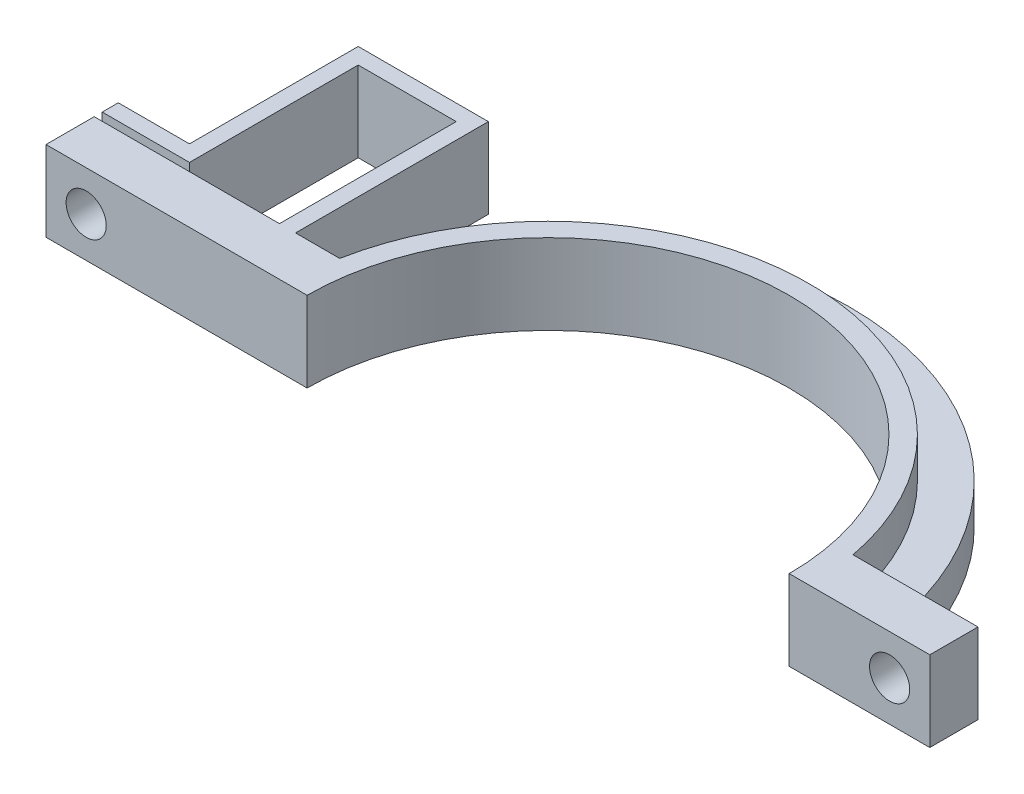
ISO-10303-21;
HEADER;
FILE_DESCRIPTION(('STEP AP214'),'2;1');
FILE_NAME('part.step','',(''),(''),'','','');
FILE_SCHEMA(('AUTOMOTIVE_DESIGN { 1 0 10303 214 1 1 1 1 }'));
ENDSEC;
DATA;
#1=APPLICATION_CONTEXT('core data for automotive mechanical design processes');
#2=APPLICATION_PROTOCOL_DEFINITION('international standard','automotive_design',2000,#1);
#3=PRODUCT_CONTEXT('',#1,'mechanical');
#4=PRODUCT('Part','Part','',(#3));
#5=PRODUCT_RELATED_PRODUCT_CATEGORY('part','',(#4));
#6=PRODUCT_DEFINITION_FORMATION('','',#4);
#7=PRODUCT_DEFINITION_CONTEXT('part definition',#1,'design');
#8=PRODUCT_DEFINITION('design','',#6,#7);
#9=PRODUCT_DEFINITION_SHAPE('','',#8);
#10=(LENGTH_UNIT() NAMED_UNIT(*) SI_UNIT(.MILLI.,.METRE.));
#11=(NAMED_UNIT(*) PLANE_ANGLE_UNIT() SI_UNIT($,.RADIAN.));
#12=(NAMED_UNIT(*) SI_UNIT($,.STERADIAN.) SOLID_ANGLE_UNIT());
#13=UNCERTAINTY_MEASURE_WITH_UNIT(LENGTH_MEASURE(1.E-05),#10,'distance_accuracy_value','');
#14=(GEOMETRIC_REPRESENTATION_CONTEXT(3) GLOBAL_UNCERTAINTY_ASSIGNED_CONTEXT((#13)) GLOBAL_UNIT_ASSIGNED_CONTEXT((#10,
#11,#12)) REPRESENTATION_CONTEXT('',''));
#15=CARTESIAN_POINT('',(0.,0.,0.));
#16=DIRECTION('',(0.,0.,1.));
#17=DIRECTION('',(1.,0.,0.));
#18=AXIS2_PLACEMENT_3D('',#15,#16,#17);
#19=CARTESIAN_POINT('',(0.,10.,-6.));
#20=DIRECTION('',(0.,0.,-1.));
#21=DIRECTION('',(-1.,0.,0.));
#22=AXIS2_PLACEMENT_3D('',#19,#20,#21);
#23=PLANE('',#22);
#24=DIRECTION('',(1.,0.,0.));
#25=VECTOR('',#24,1.);
#26=CARTESIAN_POINT('',(0.,0.,-6.));
#27=LINE('',#26,#25);
#28=CARTESIAN_POINT('',(-37.4413525073689,0.,-6.));
#29=VERTEX_POINT('',#28);
#30=CARTESIAN_POINT('',(-37.0168880377592,0.,-6.));
#31=VERTEX_POINT('',#30);
#32=EDGE_CURVE('E288',#29,#31,#27,.T.);
#33=ORIENTED_EDGE('',*,*,#32,.F.);
#34=DIRECTION('',(0.,-1.,0.));
#35=VECTOR('',#34,1.);
#36=CARTESIAN_POINT('',(-37.4413525073689,10.,-6.));
#37=LINE('',#36,#35);
#38=CARTESIAN_POINT('',(-37.4413525073689,10.,-6.));
#39=VERTEX_POINT('',#38);
#40=EDGE_CURVE('E362',#39,#29,#37,.T.);
#41=ORIENTED_EDGE('',*,*,#40,.F.);
#42=DIRECTION('',(1.,0.,0.));
#43=VECTOR('',#42,1.);
#44=CARTESIAN_POINT('',(0.,10.,-6.));
#45=LINE('',#44,#43);
#46=CARTESIAN_POINT('',(-31.9413525073689,10.,-6.));
#47=VERTEX_POINT('',#46);
#48=EDGE_CURVE('E261',#39,#47,#45,.T.);
#49=ORIENTED_EDGE('',*,*,#48,.T.);
#50=DIRECTION('',(0.,-1.,0.));
#51=VECTOR('',#50,1.);
#52=CARTESIAN_POINT('',(-31.9413525073689,10.,-6.));
#53=LINE('',#52,#51);
#54=CARTESIAN_POINT('',(-31.9413525073689,5.,-6.));
#55=VERTEX_POINT('',#54);
#56=EDGE_CURVE('E315',#47,#55,#53,.T.);
#57=ORIENTED_EDGE('',*,*,#56,.T.);
#58=DIRECTION('',(1.,0.,0.));
#59=VECTOR('',#58,1.);
#60=CARTESIAN_POINT('',(0.,5.,-6.));
#61=LINE('',#60,#59);
#62=CARTESIAN_POINT('',(-37.0168880377592,5.,-6.));
#63=VERTEX_POINT('',#62);
#64=EDGE_CURVE('E238',#63,#55,#61,.T.);
#65=ORIENTED_EDGE('',*,*,#64,.F.);
#66=DIRECTION('',(0.,-1.,0.));
#67=VECTOR('',#66,1.);
#68=CARTESIAN_POINT('',(-37.0168880377592,5.,-6.));
#69=LINE('',#68,#67);
#70=EDGE_CURVE('E231',#63,#31,#69,.T.);
#71=ORIENTED_EDGE('',*,*,#70,.T.);
#72=EDGE_LOOP('',(#33,#41,#49,#57,#65,#71));
#73=FACE_BOUND('',#72,.T.);
#74=ADVANCED_FACE('F47',(#73),#23,.T.);
#75=CARTESIAN_POINT('',(0.,10.,-6.));
#76=DIRECTION('',(0.,0.,1.));
#77=DIRECTION('',(1.,0.,0.));
#78=AXIS2_PLACEMENT_3D('',#75,#76,#77);
#79=PLANE('',#78);
#80=CARTESIAN_POINT('',(42.5,5.,-6.00000000000001));
#81=DIRECTION('',(0.,0.,1.));
#82=DIRECTION('',(1.,0.,0.));
#83=AXIS2_PLACEMENT_3D('',#80,#81,#82);
#84=CIRCLE('',#83,2.5);
#85=CARTESIAN_POINT('',(45.,5.,-6.00000000000001));
#86=VERTEX_POINT('',#85);
#87=EDGE_CURVE('E439',#86,#86,#84,.T.);
#88=ORIENTED_EDGE('',*,*,#87,.T.);
#89=EDGE_LOOP('',(#88));
#90=FACE_BOUND('',#89,.T.);
#91=DIRECTION('',(0.,-1.,0.));
#92=VECTOR('',#91,1.);
#93=CARTESIAN_POINT('',(37.0168880377592,5.,-6.00000000000001));
#94=LINE('',#93,#92);
#95=CARTESIAN_POINT('',(37.0168880377592,5.,-6.00000000000001));
#96=VERTEX_POINT('',#95);
#97=CARTESIAN_POINT('',(37.0168880377592,0.,-6.00000000000001));
#98=VERTEX_POINT('',#97);
#99=EDGE_CURVE('E72',#96,#98,#94,.T.);
#100=ORIENTED_EDGE('',*,*,#99,.F.);
#101=DIRECTION('',(-1.,0.,0.));
#102=VECTOR('',#101,1.);
#103=CARTESIAN_POINT('',(0.,5.,-6.));
#104=LINE('',#103,#102);
#105=CARTESIAN_POINT('',(31.9413525073689,5.,-6.));
#106=VERTEX_POINT('',#105);
#107=EDGE_CURVE('E242',#96,#106,#104,.T.);
#108=ORIENTED_EDGE('',*,*,#107,.T.);
#109=DIRECTION('',(0.,-1.,0.));
#110=VECTOR('',#109,1.);
#111=CARTESIAN_POINT('',(31.9413525073689,10.,-6.));
#112=LINE('',#111,#110);
#113=CARTESIAN_POINT('',(31.9413525073689,10.,-6.));
#114=VERTEX_POINT('',#113);
#115=EDGE_CURVE('E319',#114,#106,#112,.T.);
#116=ORIENTED_EDGE('',*,*,#115,.F.);
#117=DIRECTION('',(-1.,0.,0.));
#118=VECTOR('',#117,1.);
#119=CARTESIAN_POINT('',(0.,10.,-6.));
#120=LINE('',#119,#118);
#121=CARTESIAN_POINT('',(47.5,10.,-6.00000000000001));
#122=VERTEX_POINT('',#121);
#123=EDGE_CURVE('E254',#122,#114,#120,.T.);
#124=ORIENTED_EDGE('',*,*,#123,.F.);
#125=DIRECTION('',(0.,-1.,0.));
#126=VECTOR('',#125,1.);
#127=CARTESIAN_POINT('',(47.5,10.,-6.00000000000001));
#128=LINE('',#127,#126);
#129=CARTESIAN_POINT('',(47.5,0.,-6.00000000000001));
#130=VERTEX_POINT('',#129);
#131=EDGE_CURVE('E57',#122,#130,#128,.T.);
#132=ORIENTED_EDGE('',*,*,#131,.T.);
#133=DIRECTION('',(-1.,0.,0.));
#134=VECTOR('',#133,1.);
#135=CARTESIAN_POINT('',(0.,0.,-6.));
#136=LINE('',#135,#134);
#137=EDGE_CURVE('E285',#130,#98,#136,.T.);
#138=ORIENTED_EDGE('',*,*,#137,.T.);
#139=EDGE_LOOP('',(#100,#108,#116,#124,#132,#138));
#140=FACE_BOUND('',#139,.T.);
#141=ADVANCED_FACE('F326',(#90,#140),#79,.F.);
#142=CARTESIAN_POINT('',(-57.5,5.,-6.));
#143=DIRECTION('',(0.,0.,-1.));
#144=DIRECTION('',(-1.,0.,0.));
#145=AXIS2_PLACEMENT_3D('',#142,#143,#144);
#146=CIRCLE('',#145,2.5);
#147=CARTESIAN_POINT('',(-60.,5.,-6.));
#148=VERTEX_POINT('',#147);
#149=EDGE_CURVE('E444',#148,#148,#146,.T.);
#150=ORIENTED_EDGE('',*,*,#149,.F.);
#151=EDGE_LOOP('',(#150));
#152=FACE_BOUND('',#151,.T.);
#153=DIRECTION('',(0.,-1.,0.));
#154=VECTOR('',#153,1.);
#155=CARTESIAN_POINT('',(-39.4413525073689,10.,-6.));
#156=LINE('',#155,#154);
#157=CARTESIAN_POINT('',(-39.4413525073689,10.,-6.));
#158=VERTEX_POINT('',#157);
#159=CARTESIAN_POINT('',(-39.4413525073689,0.,-6.));
#160=VERTEX_POINT('',#159);
#161=EDGE_CURVE('E356',#158,#160,#156,.T.);
#162=ORIENTED_EDGE('',*,*,#161,.T.);
#163=CARTESIAN_POINT('',(-62.5,0.,-6.));
#164=VERTEX_POINT('',#163);
#165=EDGE_CURVE('E289',#164,#160,#27,.T.);
#166=ORIENTED_EDGE('',*,*,#165,.F.);
#167=DIRECTION('',(0.,-1.,0.));
#168=VECTOR('',#167,1.);
#169=CARTESIAN_POINT('',(-62.5,10.,-6.));
#170=LINE('',#169,#168);
#171=CARTESIAN_POINT('',(-62.5,10.,-6.));
#172=VERTEX_POINT('',#171);
#173=EDGE_CURVE('E312',#172,#164,#170,.T.);
#174=ORIENTED_EDGE('',*,*,#173,.F.);
#175=EDGE_CURVE('E262',#172,#158,#45,.T.);
#176=ORIENTED_EDGE('',*,*,#175,.T.);
#177=EDGE_LOOP('',(#162,#166,#174,#176));
#178=FACE_BOUND('',#177,.T.);
#179=ADVANCED_FACE('F355',(#152,#178),#23,.T.);
#180=CARTESIAN_POINT('',(0.,10.,0.));
#181=DIRECTION('',(0.,0.,-1.));
#182=DIRECTION('',(-1.,0.,0.));
#183=AXIS2_PLACEMENT_3D('',#180,#181,#182);
#184=PLANE('',#183);
#185=CARTESIAN_POINT('',(42.5,5.,0.));
#186=DIRECTION('',(0.,0.,1.));
#187=DIRECTION('',(1.,0.,0.));
#188=AXIS2_PLACEMENT_3D('',#185,#186,#187);
#189=CIRCLE('',#188,2.5);
#190=CARTESIAN_POINT('',(45.,5.,0.));
#191=VERTEX_POINT('',#190);
#192=EDGE_CURVE('E455',#191,#191,#189,.T.);
#193=ORIENTED_EDGE('',*,*,#192,.F.);
#194=EDGE_LOOP('',(#193));
#195=FACE_BOUND('',#194,.T.);
#196=DIRECTION('',(1.,0.,0.));
#197=VECTOR('',#196,1.);
#198=CARTESIAN_POINT('',(0.,0.,0.));
#199=LINE('',#198,#197);
#200=CARTESIAN_POINT('',(30.,0.,0.));
#201=VERTEX_POINT('',#200);
#202=CARTESIAN_POINT('',(47.5,0.,0.));
#203=VERTEX_POINT('',#202);
#204=EDGE_CURVE('E245',#201,#203,#199,.T.);
#205=ORIENTED_EDGE('',*,*,#204,.T.);
#206=DIRECTION('',(0.,-1.,0.));
#207=VECTOR('',#206,1.);
#208=CARTESIAN_POINT('',(47.5,10.,0.));
#209=LINE('',#208,#207);
#210=CARTESIAN_POINT('',(47.5,10.,0.));
#211=VERTEX_POINT('',#210);
#212=EDGE_CURVE('E11',#211,#203,#209,.T.);
#213=ORIENTED_EDGE('',*,*,#212,.F.);
#214=DIRECTION('',(1.,0.,0.));
#215=VECTOR('',#214,1.);
#216=CARTESIAN_POINT('',(0.,10.,0.));
#217=LINE('',#216,#215);
#218=CARTESIAN_POINT('',(30.,10.,0.));
#219=VERTEX_POINT('',#218);
#220=EDGE_CURVE('E246',#219,#211,#217,.T.);
#221=ORIENTED_EDGE('',*,*,#220,.F.);
#222=DIRECTION('',(0.,-1.,0.));
#223=VECTOR('',#222,1.);
#224=CARTESIAN_POINT('',(30.,10.,0.));
#225=LINE('',#224,#223);
#226=EDGE_CURVE('E278',#219,#201,#225,.T.);
#227=ORIENTED_EDGE('',*,*,#226,.T.);
#228=EDGE_LOOP('',(#205,#213,#221,#227));
#229=FACE_BOUND('',#228,.T.);
#230=ADVANCED_FACE('F49',(#195,#229),#184,.F.);
#231=CARTESIAN_POINT('',(47.5,10.,0.));
#232=DIRECTION('',(1.,0.,0.));
#233=DIRECTION('',(0.,0.,-1.));
#234=AXIS2_PLACEMENT_3D('',#231,#232,#233);
#235=PLANE('',#234);
#236=DIRECTION('',(0.,0.,1.));
#237=VECTOR('',#236,1.);
#238=CARTESIAN_POINT('',(47.5,0.,0.));
#239=LINE('',#238,#237);
#240=EDGE_CURVE('E281',#130,#203,#239,.T.);
#241=ORIENTED_EDGE('',*,*,#240,.F.);
#242=ORIENTED_EDGE('',*,*,#131,.F.);
#243=DIRECTION('',(0.,0.,1.));
#244=VECTOR('',#243,1.);
#245=CARTESIAN_POINT('',(47.5,10.,0.));
#246=LINE('',#245,#244);
#247=EDGE_CURVE('E249',#122,#211,#246,.T.);
#248=ORIENTED_EDGE('',*,*,#247,.T.);
#249=ORIENTED_EDGE('',*,*,#212,.T.);
#250=EDGE_LOOP('',(#241,#242,#248,#249));
#251=FACE_BOUND('',#250,.T.);
#252=ADVANCED_FACE('F334',(#251),#235,.T.);
#253=CARTESIAN_POINT('',(0.,10.,0.));
#254=DIRECTION('',(0.,-1.,0.));
#255=DIRECTION('',(0.,0.,-1.));
#256=AXIS2_PLACEMENT_3D('',#253,#254,#255);
#257=CYLINDRICAL_SURFACE('',#256,32.5);
#258=ORIENTED_EDGE('',*,*,#115,.T.);
#259=CARTESIAN_POINT('',(0.,5.,0.));
#260=DIRECTION('',(0.,1.,0.));
#261=DIRECTION('',(0.,0.,1.));
#262=AXIS2_PLACEMENT_3D('',#259,#260,#261);
#263=CIRCLE('',#262,32.5);
#264=EDGE_CURVE('E220',#106,#55,#263,.T.);
#265=ORIENTED_EDGE('',*,*,#264,.T.);
#266=ORIENTED_EDGE('',*,*,#56,.F.);
#267=CARTESIAN_POINT('',(0.,10.,0.));
#268=DIRECTION('',(0.,1.,0.));
#269=DIRECTION('',(0.,0.,1.));
#270=AXIS2_PLACEMENT_3D('',#267,#268,#269);
#271=CIRCLE('',#270,32.5);
#272=EDGE_CURVE('E257',#114,#47,#271,.T.);
#273=ORIENTED_EDGE('',*,*,#272,.F.);
#274=EDGE_LOOP('',(#258,#265,#266,#273));
#275=FACE_BOUND('',#274,.T.);
#276=ADVANCED_FACE('F491',(#275),#257,.T.);
#277=CARTESIAN_POINT('',(-62.5,10.,0.));
#278=DIRECTION('',(-1.,0.,0.));
#279=DIRECTION('',(0.,0.,1.));
#280=AXIS2_PLACEMENT_3D('',#277,#278,#279);
#281=PLANE('',#280);
#282=DIRECTION('',(0.,0.,-1.));
#283=VECTOR('',#282,1.);
#284=CARTESIAN_POINT('',(-62.5,0.,0.));
#285=LINE('',#284,#283);
#286=CARTESIAN_POINT('',(-62.5,0.,0.));
#287=VERTEX_POINT('',#286);
#288=EDGE_CURVE('E293',#287,#164,#285,.T.);
#289=ORIENTED_EDGE('',*,*,#288,.F.);
#290=DIRECTION('',(0.,-1.,0.));
#291=VECTOR('',#290,1.);
#292=CARTESIAN_POINT('',(-62.5,10.,0.));
#293=LINE('',#292,#291);
#294=CARTESIAN_POINT('',(-62.5,10.,0.));
#295=VERTEX_POINT('',#294);
#296=EDGE_CURVE('E308',#295,#287,#293,.T.);
#297=ORIENTED_EDGE('',*,*,#296,.F.);
#298=DIRECTION('',(0.,0.,-1.));
#299=VECTOR('',#298,1.);
#300=CARTESIAN_POINT('',(-62.5,10.,0.));
#301=LINE('',#300,#299);
#302=EDGE_CURVE('E266',#295,#172,#301,.T.);
#303=ORIENTED_EDGE('',*,*,#302,.T.);
#304=ORIENTED_EDGE('',*,*,#173,.T.);
#305=EDGE_LOOP('',(#289,#297,#303,#304));
#306=FACE_BOUND('',#305,.T.);
#307=ADVANCED_FACE('F350',(#306),#281,.T.);
#308=CARTESIAN_POINT('',(0.,10.,0.));
#309=DIRECTION('',(0.,0.,1.));
#310=DIRECTION('',(1.,0.,0.));
#311=AXIS2_PLACEMENT_3D('',#308,#309,#310);
#312=PLANE('',#311);
#313=CARTESIAN_POINT('',(-57.5,5.,0.));
#314=DIRECTION('',(0.,0.,1.));
#315=DIRECTION('',(1.,0.,0.));
#316=AXIS2_PLACEMENT_3D('',#313,#314,#315);
#317=CIRCLE('',#316,2.5);
#318=CARTESIAN_POINT('',(-55.,5.,0.));
#319=VERTEX_POINT('',#318);
#320=EDGE_CURVE('E458',#319,#319,#317,.T.);
#321=ORIENTED_EDGE('',*,*,#320,.F.);
#322=EDGE_LOOP('',(#321));
#323=FACE_BOUND('',#322,.T.);
#324=ORIENTED_EDGE('',*,*,#296,.T.);
#325=DIRECTION('',(-1.,0.,0.));
#326=VECTOR('',#325,1.);
#327=CARTESIAN_POINT('',(0.,0.,0.));
#328=LINE('',#327,#326);
#329=CARTESIAN_POINT('',(-30.,0.,0.));
#330=VERTEX_POINT('',#329);
#331=EDGE_CURVE('E297',#330,#287,#328,.T.);
#332=ORIENTED_EDGE('',*,*,#331,.F.);
#333=DIRECTION('',(0.,-1.,0.));
#334=VECTOR('',#333,1.);
#335=CARTESIAN_POINT('',(-30.,10.,0.));
#336=LINE('',#335,#334);
#337=CARTESIAN_POINT('',(-30.,10.,0.));
#338=VERTEX_POINT('',#337);
#339=EDGE_CURVE('E305',#338,#330,#336,.T.);
#340=ORIENTED_EDGE('',*,*,#339,.F.);
#341=DIRECTION('',(-1.,0.,0.));
#342=VECTOR('',#341,1.);
#343=CARTESIAN_POINT('',(0.,10.,0.));
#344=LINE('',#343,#342);
#345=EDGE_CURVE('E270',#338,#295,#344,.T.);
#346=ORIENTED_EDGE('',*,*,#345,.T.);
#347=EDGE_LOOP('',(#324,#332,#340,#346));
#348=FACE_BOUND('',#347,.T.);
#349=ADVANCED_FACE('F345',(#323,#348),#312,.T.);
#350=CARTESIAN_POINT('',(0.,10.,0.));
#351=DIRECTION('',(0.,-1.,0.));
#352=DIRECTION('',(0.,0.,-1.));
#353=AXIS2_PLACEMENT_3D('',#350,#351,#352);
#354=CYLINDRICAL_SURFACE('',#353,30.);
#355=CARTESIAN_POINT('',(0.,0.,0.));
#356=DIRECTION('',(0.,1.,0.));
#357=DIRECTION('',(0.,0.,1.));
#358=AXIS2_PLACEMENT_3D('',#355,#356,#357);
#359=CIRCLE('',#358,30.);
#360=EDGE_CURVE('E250',#201,#330,#359,.T.);
#361=ORIENTED_EDGE('',*,*,#360,.F.);
#362=ORIENTED_EDGE('',*,*,#226,.F.);
#363=CARTESIAN_POINT('',(0.,10.,0.));
#364=DIRECTION('',(0.,1.,0.));
#365=DIRECTION('',(0.,0.,1.));
#366=AXIS2_PLACEMENT_3D('',#363,#364,#365);
#367=CIRCLE('',#366,30.);
#368=EDGE_CURVE('E274',#219,#338,#367,.T.);
#369=ORIENTED_EDGE('',*,*,#368,.T.);
#370=ORIENTED_EDGE('',*,*,#339,.T.);
#371=EDGE_LOOP('',(#361,#362,#369,#370));
#372=FACE_BOUND('',#371,.T.);
#373=ADVANCED_FACE('F341',(#372),#354,.F.);
#374=CARTESIAN_POINT('',(0.,10.,0.));
#375=DIRECTION('',(0.,1.,0.));
#376=DIRECTION('',(0.,0.,1.));
#377=AXIS2_PLACEMENT_3D('',#374,#375,#376);
#378=PLANE('',#377);
#379=ORIENTED_EDGE('',*,*,#220,.T.);
#380=ORIENTED_EDGE('',*,*,#247,.F.);
#381=ORIENTED_EDGE('',*,*,#123,.T.);
#382=ORIENTED_EDGE('',*,*,#272,.T.);
#383=ORIENTED_EDGE('',*,*,#48,.F.);
#384=DIRECTION('',(0.,0.,-1.));
#385=VECTOR('',#384,1.);
#386=CARTESIAN_POINT('',(-37.4413525073689,10.,0.));
#387=LINE('',#386,#385);
#388=CARTESIAN_POINT('',(-37.4413525073689,10.,-30.));
#389=VERTEX_POINT('',#388);
#390=EDGE_CURVE('E472',#39,#389,#387,.T.);
#391=ORIENTED_EDGE('',*,*,#390,.T.);
#392=DIRECTION('',(-1.,0.,0.));
#393=VECTOR('',#392,1.);
#394=CARTESIAN_POINT('',(0.,10.,-30.));
#395=LINE('',#394,#393);
#396=CARTESIAN_POINT('',(-53.6413525073689,10.,-30.));
#397=VERTEX_POINT('',#396);
#398=EDGE_CURVE('E421',#389,#397,#395,.T.);
#399=ORIENTED_EDGE('',*,*,#398,.T.);
#400=DIRECTION('',(0.,0.,1.));
#401=VECTOR('',#400,1.);
#402=CARTESIAN_POINT('',(-53.6413525073689,10.,0.));
#403=LINE('',#402,#401);
#404=CARTESIAN_POINT('',(-53.6413525073689,10.,-9.));
#405=VERTEX_POINT('',#404);
#406=EDGE_CURVE('E432',#397,#405,#403,.T.);
#407=ORIENTED_EDGE('',*,*,#406,.T.);
#408=DIRECTION('',(-1.,0.,0.));
#409=VECTOR('',#408,1.);
#410=CARTESIAN_POINT('',(0.,10.,-9.00000000000002));
#411=LINE('',#410,#409);
#412=CARTESIAN_POINT('',(-62.5,10.,-9.));
#413=VERTEX_POINT('',#412);
#414=EDGE_CURVE('E204',#405,#413,#411,.T.);
#415=ORIENTED_EDGE('',*,*,#414,.T.);
#416=DIRECTION('',(0.,0.,1.));
#417=VECTOR('',#416,1.);
#418=CARTESIAN_POINT('',(-62.4999999999999,10.,4.33680868994201E-13));
#419=LINE('',#418,#417);
#420=CARTESIAN_POINT('',(-62.5,10.,-7.));
#421=VERTEX_POINT('',#420);
#422=EDGE_CURVE('E199',#413,#421,#419,.T.);
#423=ORIENTED_EDGE('',*,*,#422,.T.);
#424=DIRECTION('',(1.,0.,0.));
#425=VECTOR('',#424,1.);
#426=CARTESIAN_POINT('',(0.,10.,-6.99999999999999));
#427=LINE('',#426,#425);
#428=CARTESIAN_POINT('',(-51.6413525073689,10.,-7.));
#429=VERTEX_POINT('',#428);
#430=EDGE_CURVE('E186',#421,#429,#427,.T.);
#431=ORIENTED_EDGE('',*,*,#430,.T.);
#432=DIRECTION('',(0.,0.,1.));
#433=VECTOR('',#432,1.);
#434=CARTESIAN_POINT('',(-51.6413525073689,10.,0.));
#435=LINE('',#434,#433);
#436=CARTESIAN_POINT('',(-51.6413525073689,10.,-28.));
#437=VERTEX_POINT('',#436);
#438=EDGE_CURVE('E198',#437,#429,#435,.T.);
#439=ORIENTED_EDGE('',*,*,#438,.F.);
#440=DIRECTION('',(-1.,0.,0.));
#441=VECTOR('',#440,1.);
#442=CARTESIAN_POINT('',(0.,10.,-28.));
#443=LINE('',#442,#441);
#444=CARTESIAN_POINT('',(-39.4413525073689,10.,-28.));
#445=VERTEX_POINT('',#444);
#446=EDGE_CURVE('E379',#445,#437,#443,.T.);
#447=ORIENTED_EDGE('',*,*,#446,.F.);
#448=DIRECTION('',(0.,0.,-1.));
#449=VECTOR('',#448,1.);
#450=CARTESIAN_POINT('',(-39.4413525073689,10.,0.));
#451=LINE('',#450,#449);
#452=EDGE_CURVE('E469',#158,#445,#451,.T.);
#453=ORIENTED_EDGE('',*,*,#452,.F.);
#454=ORIENTED_EDGE('',*,*,#175,.F.);
#455=ORIENTED_EDGE('',*,*,#302,.F.);
#456=ORIENTED_EDGE('',*,*,#345,.F.);
#457=ORIENTED_EDGE('',*,*,#368,.F.);
#458=EDGE_LOOP('',(#379,#380,#381,#382,#383,#391,#399,#407,#415,#423,#431,#439,#447,#453,#454,
#455,#456,#457));
#459=FACE_BOUND('',#458,.T.);
#460=ADVANCED_FACE('F202',(#459),#378,.T.);
#461=CARTESIAN_POINT('',(0.,0.,0.));
#462=DIRECTION('',(0.,1.,0.));
#463=DIRECTION('',(0.,0.,1.));
#464=AXIS2_PLACEMENT_3D('',#461,#462,#463);
#465=PLANE('',#464);
#466=ORIENTED_EDGE('',*,*,#331,.T.);
#467=ORIENTED_EDGE('',*,*,#288,.T.);
#468=ORIENTED_EDGE('',*,*,#165,.T.);
#469=DIRECTION('',(0.,0.,-1.));
#470=VECTOR('',#469,1.);
#471=CARTESIAN_POINT('',(-39.4413525073689,0.,0.));
#472=LINE('',#471,#470);
#473=CARTESIAN_POINT('',(-39.4413525073689,0.,-28.));
#474=VERTEX_POINT('',#473);
#475=EDGE_CURVE('E387',#160,#474,#472,.T.);
#476=ORIENTED_EDGE('',*,*,#475,.T.);
#477=DIRECTION('',(-1.,0.,0.));
#478=VECTOR('',#477,1.);
#479=CARTESIAN_POINT('',(0.,0.,-28.));
#480=LINE('',#479,#478);
#481=CARTESIAN_POINT('',(-51.6413525073689,0.,-28.));
#482=VERTEX_POINT('',#481);
#483=EDGE_CURVE('E377',#474,#482,#480,.T.);
#484=ORIENTED_EDGE('',*,*,#483,.T.);
#485=DIRECTION('',(0.,0.,1.));
#486=VECTOR('',#485,1.);
#487=CARTESIAN_POINT('',(-51.6413525073689,0.,0.));
#488=LINE('',#487,#486);
#489=CARTESIAN_POINT('',(-51.6413525073689,0.,-7.));
#490=VERTEX_POINT('',#489);
#491=EDGE_CURVE('E382',#482,#490,#488,.T.);
#492=ORIENTED_EDGE('',*,*,#491,.T.);
#493=DIRECTION('',(1.,0.,0.));
#494=VECTOR('',#493,1.);
#495=CARTESIAN_POINT('',(0.,0.,-6.99999999999999));
#496=LINE('',#495,#494);
#497=CARTESIAN_POINT('',(-62.5,0.,-7.));
#498=VERTEX_POINT('',#497);
#499=EDGE_CURVE('E385',#498,#490,#496,.T.);
#500=ORIENTED_EDGE('',*,*,#499,.F.);
#501=DIRECTION('',(0.,0.,1.));
#502=VECTOR('',#501,1.);
#503=CARTESIAN_POINT('',(-62.4999999999999,0.,4.33680868994201E-13));
#504=LINE('',#503,#502);
#505=CARTESIAN_POINT('',(-62.5,0.,-9.));
#506=VERTEX_POINT('',#505);
#507=EDGE_CURVE('E213',#506,#498,#504,.T.);
#508=ORIENTED_EDGE('',*,*,#507,.F.);
#509=DIRECTION('',(-1.,0.,0.));
#510=VECTOR('',#509,1.);
#511=CARTESIAN_POINT('',(0.,0.,-9.00000000000002));
#512=LINE('',#511,#510);
#513=CARTESIAN_POINT('',(-53.6413525073689,0.,-9.));
#514=VERTEX_POINT('',#513);
#515=EDGE_CURVE('E209',#514,#506,#512,.T.);
#516=ORIENTED_EDGE('',*,*,#515,.F.);
#517=DIRECTION('',(0.,0.,1.));
#518=VECTOR('',#517,1.);
#519=CARTESIAN_POINT('',(-53.6413525073689,0.,0.));
#520=LINE('',#519,#518);
#521=CARTESIAN_POINT('',(-53.6413525073689,0.,-30.));
#522=VERTEX_POINT('',#521);
#523=EDGE_CURVE('E399',#522,#514,#520,.T.);
#524=ORIENTED_EDGE('',*,*,#523,.F.);
#525=DIRECTION('',(-1.,0.,0.));
#526=VECTOR('',#525,1.);
#527=CARTESIAN_POINT('',(0.,0.,-30.));
#528=LINE('',#527,#526);
#529=CARTESIAN_POINT('',(-37.4413525073689,0.,-30.));
#530=VERTEX_POINT('',#529);
#531=EDGE_CURVE('E396',#530,#522,#528,.T.);
#532=ORIENTED_EDGE('',*,*,#531,.F.);
#533=DIRECTION('',(0.,0.,-1.));
#534=VECTOR('',#533,1.);
#535=CARTESIAN_POINT('',(-37.4413525073689,0.,0.));
#536=LINE('',#535,#534);
#537=EDGE_CURVE('E64',#29,#530,#536,.T.);
#538=ORIENTED_EDGE('',*,*,#537,.F.);
#539=ORIENTED_EDGE('',*,*,#32,.T.);
#540=CARTESIAN_POINT('',(0.,0.,0.));
#541=DIRECTION('',(0.,1.,0.));
#542=DIRECTION('',(0.,0.,1.));
#543=AXIS2_PLACEMENT_3D('',#540,#541,#542);
#544=CIRCLE('',#543,37.5);
#545=EDGE_CURVE('E215',#98,#31,#544,.T.);
#546=ORIENTED_EDGE('',*,*,#545,.F.);
#547=ORIENTED_EDGE('',*,*,#137,.F.);
#548=ORIENTED_EDGE('',*,*,#240,.T.);
#549=ORIENTED_EDGE('',*,*,#204,.F.);
#550=ORIENTED_EDGE('',*,*,#360,.T.);
#551=EDGE_LOOP('',(#466,#467,#468,#476,#484,#492,#500,#508,#516,#524,#532,#538,#539,#546,#547,
#548,#549,#550));
#552=FACE_BOUND('',#551,.T.);
#553=ADVANCED_FACE('F332',(#552),#465,.F.);
#554=CARTESIAN_POINT('',(0.,5.,0.));
#555=DIRECTION('',(0.,1.,0.));
#556=DIRECTION('',(0.,0.,1.));
#557=AXIS2_PLACEMENT_3D('',#554,#555,#556);
#558=PLANE('',#557);
#559=ORIENTED_EDGE('',*,*,#107,.F.);
#560=CARTESIAN_POINT('',(0.,5.,0.));
#561=DIRECTION('',(0.,1.,0.));
#562=DIRECTION('',(0.,0.,1.));
#563=AXIS2_PLACEMENT_3D('',#560,#561,#562);
#564=CIRCLE('',#563,37.5);
#565=EDGE_CURVE('E228',#96,#63,#564,.T.);
#566=ORIENTED_EDGE('',*,*,#565,.T.);
#567=ORIENTED_EDGE('',*,*,#64,.T.);
#568=ORIENTED_EDGE('',*,*,#264,.F.);
#569=EDGE_LOOP('',(#559,#566,#567,#568));
#570=FACE_BOUND('',#569,.T.);
#571=ADVANCED_FACE('F487',(#570),#558,.T.);
#572=CARTESIAN_POINT('',(0.,5.,0.));
#573=DIRECTION('',(0.,-1.,0.));
#574=DIRECTION('',(0.,0.,-1.));
#575=AXIS2_PLACEMENT_3D('',#572,#573,#574);
#576=CYLINDRICAL_SURFACE('',#575,37.5);
#577=ORIENTED_EDGE('',*,*,#565,.F.);
#578=ORIENTED_EDGE('',*,*,#99,.T.);
#579=ORIENTED_EDGE('',*,*,#545,.T.);
#580=ORIENTED_EDGE('',*,*,#70,.F.);
#581=EDGE_LOOP('',(#577,#578,#579,#580));
#582=FACE_BOUND('',#581,.T.);
#583=ADVANCED_FACE('F485',(#582),#576,.T.);
#584=CARTESIAN_POINT('',(-62.4999999999999,10.,4.33680868994201E-13));
#585=DIRECTION('',(1.,0.,0.));
#586=DIRECTION('',(0.,0.,-1.));
#587=AXIS2_PLACEMENT_3D('',#584,#585,#586);
#588=PLANE('',#587);
#589=ORIENTED_EDGE('',*,*,#507,.T.);
#590=DIRECTION('',(0.,-1.,0.));
#591=VECTOR('',#590,1.);
#592=CARTESIAN_POINT('',(-62.5,10.,-7.));
#593=LINE('',#592,#591);
#594=EDGE_CURVE('E191',#421,#498,#593,.T.);
#595=ORIENTED_EDGE('',*,*,#594,.F.);
#596=ORIENTED_EDGE('',*,*,#422,.F.);
#597=DIRECTION('',(0.,-1.,0.));
#598=VECTOR('',#597,1.);
#599=CARTESIAN_POINT('',(-62.5,10.,-9.));
#600=LINE('',#599,#598);
#601=EDGE_CURVE('E404',#413,#506,#600,.T.);
#602=ORIENTED_EDGE('',*,*,#601,.T.);
#603=EDGE_LOOP('',(#589,#595,#596,#602));
#604=FACE_BOUND('',#603,.T.);
#605=ADVANCED_FACE('F211',(#604),#588,.F.);
#606=CARTESIAN_POINT('',(0.,10.,-6.99999999999999));
#607=DIRECTION('',(0.,0.,-1.));
#608=DIRECTION('',(-1.,0.,0.));
#609=AXIS2_PLACEMENT_3D('',#606,#607,#608);
#610=PLANE('',#609);
#611=CARTESIAN_POINT('',(-57.5,5.,-7.));
#612=DIRECTION('',(0.,0.,-1.));
#613=DIRECTION('',(-1.,0.,0.));
#614=AXIS2_PLACEMENT_3D('',#611,#612,#613);
#615=CIRCLE('',#614,2.5);
#616=CARTESIAN_POINT('',(-60.,5.,-7.));
#617=VERTEX_POINT('',#616);
#618=EDGE_CURVE('E448',#617,#617,#615,.T.);
#619=ORIENTED_EDGE('',*,*,#618,.T.);
#620=EDGE_LOOP('',(#619));
#621=FACE_BOUND('',#620,.T.);
#622=ORIENTED_EDGE('',*,*,#499,.T.);
#623=DIRECTION('',(0.,-1.,0.));
#624=VECTOR('',#623,1.);
#625=CARTESIAN_POINT('',(-51.6413525073689,10.,-7.));
#626=LINE('',#625,#624);
#627=EDGE_CURVE('E193',#429,#490,#626,.T.);
#628=ORIENTED_EDGE('',*,*,#627,.F.);
#629=ORIENTED_EDGE('',*,*,#430,.F.);
#630=ORIENTED_EDGE('',*,*,#594,.T.);
#631=EDGE_LOOP('',(#622,#628,#629,#630));
#632=FACE_BOUND('',#631,.T.);
#633=ADVANCED_FACE('F189',(#621,#632),#610,.F.);
#634=CARTESIAN_POINT('',(-51.6413525073689,10.,0.));
#635=DIRECTION('',(1.,0.,0.));
#636=DIRECTION('',(0.,0.,-1.));
#637=AXIS2_PLACEMENT_3D('',#634,#635,#636);
#638=PLANE('',#637);
#639=ORIENTED_EDGE('',*,*,#491,.F.);
#640=DIRECTION('',(0.,-1.,0.));
#641=VECTOR('',#640,1.);
#642=CARTESIAN_POINT('',(-51.6413525073689,10.,-28.));
#643=LINE('',#642,#641);
#644=EDGE_CURVE('E222',#437,#482,#643,.T.);
#645=ORIENTED_EDGE('',*,*,#644,.F.);
#646=ORIENTED_EDGE('',*,*,#438,.T.);
#647=ORIENTED_EDGE('',*,*,#627,.T.);
#648=EDGE_LOOP('',(#639,#645,#646,#647));
#649=FACE_BOUND('',#648,.T.);
#650=ADVANCED_FACE('F383',(#649),#638,.T.);
#651=CARTESIAN_POINT('',(0.,10.,-28.));
#652=DIRECTION('',(0.,0.,1.));
#653=DIRECTION('',(1.,0.,0.));
#654=AXIS2_PLACEMENT_3D('',#651,#652,#653);
#655=PLANE('',#654);
#656=ORIENTED_EDGE('',*,*,#483,.F.);
#657=DIRECTION('',(0.,-1.,0.));
#658=VECTOR('',#657,1.);
#659=CARTESIAN_POINT('',(-39.4413525073689,10.,-28.));
#660=LINE('',#659,#658);
#661=EDGE_CURVE('E361',#445,#474,#660,.T.);
#662=ORIENTED_EDGE('',*,*,#661,.F.);
#663=ORIENTED_EDGE('',*,*,#446,.T.);
#664=ORIENTED_EDGE('',*,*,#644,.T.);
#665=EDGE_LOOP('',(#656,#662,#663,#664));
#666=FACE_BOUND('',#665,.T.);
#667=ADVANCED_FACE('F375',(#666),#655,.T.);
#668=CARTESIAN_POINT('',(-39.4413525073689,10.,0.));
#669=DIRECTION('',(-1.,0.,0.));
#670=DIRECTION('',(0.,0.,1.));
#671=AXIS2_PLACEMENT_3D('',#668,#669,#670);
#672=PLANE('',#671);
#673=ORIENTED_EDGE('',*,*,#475,.F.);
#674=ORIENTED_EDGE('',*,*,#161,.F.);
#675=ORIENTED_EDGE('',*,*,#452,.T.);
#676=ORIENTED_EDGE('',*,*,#661,.T.);
#677=EDGE_LOOP('',(#673,#674,#675,#676));
#678=FACE_BOUND('',#677,.T.);
#679=ADVANCED_FACE('F493',(#678),#672,.T.);
#680=CARTESIAN_POINT('',(-37.4413525073689,10.,0.));
#681=DIRECTION('',(-1.,0.,0.));
#682=DIRECTION('',(0.,0.,1.));
#683=AXIS2_PLACEMENT_3D('',#680,#681,#682);
#684=PLANE('',#683);
#685=ORIENTED_EDGE('',*,*,#537,.T.);
#686=DIRECTION('',(0.,-1.,0.));
#687=VECTOR('',#686,1.);
#688=CARTESIAN_POINT('',(-37.4413525073689,10.,-30.));
#689=LINE('',#688,#687);
#690=EDGE_CURVE('E367',#389,#530,#689,.T.);
#691=ORIENTED_EDGE('',*,*,#690,.F.);
#692=ORIENTED_EDGE('',*,*,#390,.F.);
#693=ORIENTED_EDGE('',*,*,#40,.T.);
#694=EDGE_LOOP('',(#685,#691,#692,#693));
#695=FACE_BOUND('',#694,.T.);
#696=ADVANCED_FACE('F477',(#695),#684,.F.);
#697=CARTESIAN_POINT('',(0.,10.,-30.));
#698=DIRECTION('',(0.,0.,1.));
#699=DIRECTION('',(1.,0.,0.));
#700=AXIS2_PLACEMENT_3D('',#697,#698,#699);
#701=PLANE('',#700);
#702=ORIENTED_EDGE('',*,*,#531,.T.);
#703=DIRECTION('',(0.,-1.,0.));
#704=VECTOR('',#703,1.);
#705=CARTESIAN_POINT('',(-53.6413525073689,10.,-30.));
#706=LINE('',#705,#704);
#707=EDGE_CURVE('E411',#397,#522,#706,.T.);
#708=ORIENTED_EDGE('',*,*,#707,.F.);
#709=ORIENTED_EDGE('',*,*,#398,.F.);
#710=ORIENTED_EDGE('',*,*,#690,.T.);
#711=EDGE_LOOP('',(#702,#708,#709,#710));
#712=FACE_BOUND('',#711,.T.);
#713=ADVANCED_FACE('F419',(#712),#701,.F.);
#714=CARTESIAN_POINT('',(-53.6413525073689,10.,0.));
#715=DIRECTION('',(1.,0.,0.));
#716=DIRECTION('',(0.,0.,-1.));
#717=AXIS2_PLACEMENT_3D('',#714,#715,#716);
#718=PLANE('',#717);
#719=ORIENTED_EDGE('',*,*,#523,.T.);
#720=DIRECTION('',(0.,-1.,0.));
#721=VECTOR('',#720,1.);
#722=CARTESIAN_POINT('',(-53.6413525073689,10.,-9.));
#723=LINE('',#722,#721);
#724=EDGE_CURVE('E407',#405,#514,#723,.T.);
#725=ORIENTED_EDGE('',*,*,#724,.F.);
#726=ORIENTED_EDGE('',*,*,#406,.F.);
#727=ORIENTED_EDGE('',*,*,#707,.T.);
#728=EDGE_LOOP('',(#719,#725,#726,#727));
#729=FACE_BOUND('',#728,.T.);
#730=ADVANCED_FACE('F427',(#729),#718,.F.);
#731=CARTESIAN_POINT('',(0.,10.,-9.00000000000002));
#732=DIRECTION('',(0.,0.,1.));
#733=DIRECTION('',(1.,0.,0.));
#734=AXIS2_PLACEMENT_3D('',#731,#732,#733);
#735=PLANE('',#734);
#736=CARTESIAN_POINT('',(-57.5,5.,-9.));
#737=DIRECTION('',(0.,0.,1.));
#738=DIRECTION('',(1.,0.,0.));
#739=AXIS2_PLACEMENT_3D('',#736,#737,#738);
#740=CIRCLE('',#739,2.5);
#741=CARTESIAN_POINT('',(-55.,5.,-9.));
#742=VERTEX_POINT('',#741);
#743=EDGE_CURVE('E51',#742,#742,#740,.T.);
#744=ORIENTED_EDGE('',*,*,#743,.T.);
#745=EDGE_LOOP('',(#744));
#746=FACE_BOUND('',#745,.T.);
#747=ORIENTED_EDGE('',*,*,#515,.T.);
#748=ORIENTED_EDGE('',*,*,#601,.F.);
#749=ORIENTED_EDGE('',*,*,#414,.F.);
#750=ORIENTED_EDGE('',*,*,#724,.T.);
#751=EDGE_LOOP('',(#747,#748,#749,#750));
#752=FACE_BOUND('',#751,.T.);
#753=ADVANCED_FACE('F430',(#746,#752),#735,.F.);
#754=CARTESIAN_POINT('',(-57.5,5.,-30.));
#755=DIRECTION('',(0.,0.,1.));
#756=DIRECTION('',(1.,0.,0.));
#757=AXIS2_PLACEMENT_3D('',#754,#755,#756);
#758=CYLINDRICAL_SURFACE('',#757,2.5);
#759=ORIENTED_EDGE('',*,*,#743,.F.);
#760=EDGE_LOOP('',(#759));
#761=FACE_BOUND('',#760,.T.);
#762=ORIENTED_EDGE('',*,*,#618,.F.);
#763=EDGE_LOOP('',(#762));
#764=FACE_BOUND('',#763,.T.);
#765=ADVANCED_FACE('F524',(#761,#764),#758,.F.);
#766=ORIENTED_EDGE('',*,*,#149,.T.);
#767=EDGE_LOOP('',(#766));
#768=FACE_BOUND('',#767,.T.);
#769=ORIENTED_EDGE('',*,*,#320,.T.);
#770=EDGE_LOOP('',(#769));
#771=FACE_BOUND('',#770,.T.);
#772=ADVANCED_FACE('F521',(#768,#771),#758,.F.);
#773=CARTESIAN_POINT('',(42.5,5.,-30.));
#774=DIRECTION('',(0.,0.,1.));
#775=DIRECTION('',(1.,0.,0.));
#776=AXIS2_PLACEMENT_3D('',#773,#774,#775);
#777=CYLINDRICAL_SURFACE('',#776,2.5);
#778=ORIENTED_EDGE('',*,*,#192,.T.);
#779=EDGE_LOOP('',(#778));
#780=FACE_BOUND('',#779,.T.);
#781=ORIENTED_EDGE('',*,*,#87,.F.);
#782=EDGE_LOOP('',(#781));
#783=FACE_BOUND('',#782,.T.);
#784=ADVANCED_FACE('F523',(#780,#783),#777,.F.);
#785=CLOSED_SHELL('',(#74,#141,#179,#230,#252,#276,#307,#349,#373,#460,#553,#571,#583,#605,#633,
#650,#667,#679,#696,#713,#730,#753,#765,#772,#784));
#786=MANIFOLD_SOLID_BREP('B2',#785);
#787=ADVANCED_BREP_SHAPE_REPRESENTATION('',(#18,#786),#14);
#788=SHAPE_DEFINITION_REPRESENTATION(#9,#787);
ENDSEC;
END-ISO-10303-21;
